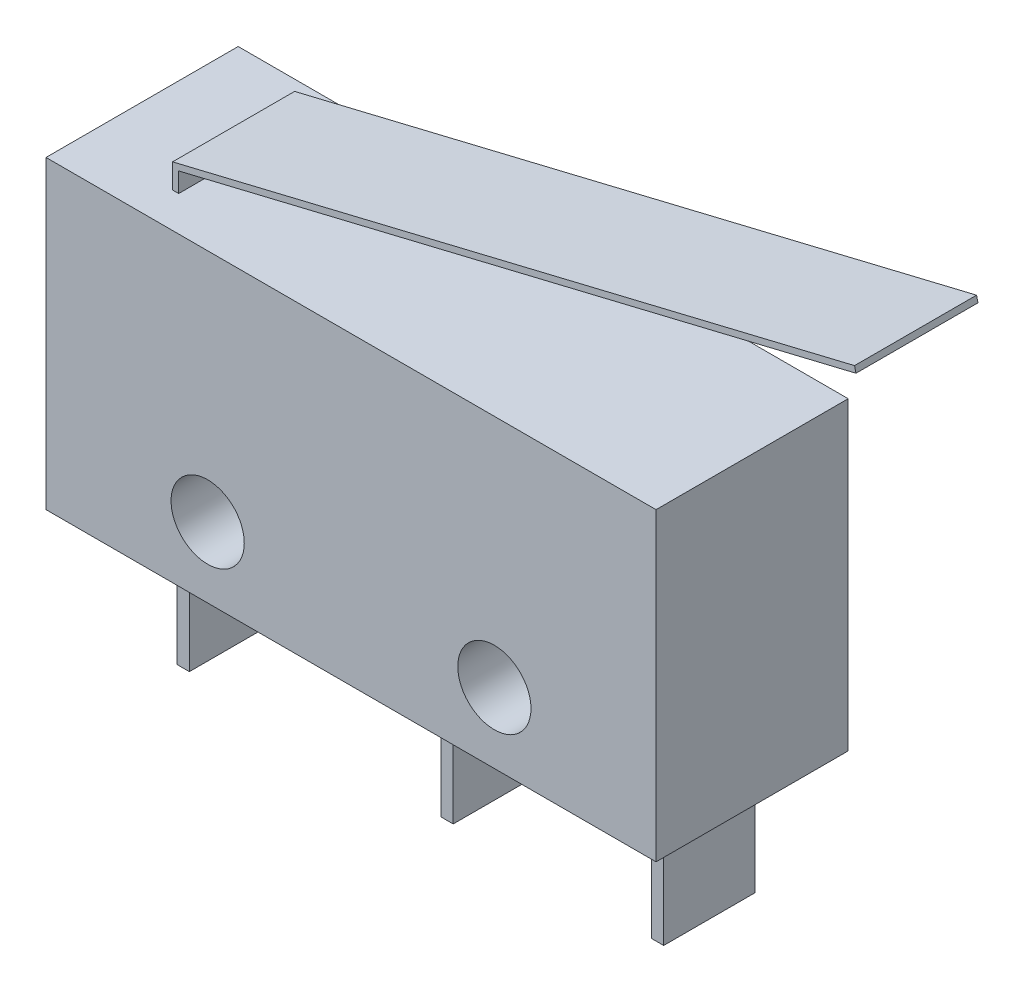
ISO-10303-21;
HEADER;
FILE_DESCRIPTION(('STEP AP214'),'2;1');
FILE_NAME('part.step','',(''),(''),'','','');
FILE_SCHEMA(('AUTOMOTIVE_DESIGN { 1 0 10303 214 1 1 1 1 }'));
ENDSEC;
DATA;
#1=APPLICATION_CONTEXT('core data for automotive mechanical design processes');
#2=APPLICATION_PROTOCOL_DEFINITION('international standard','automotive_design',2000,#1);
#3=PRODUCT_CONTEXT('',#1,'mechanical');
#4=PRODUCT('Part','Part','',(#3));
#5=PRODUCT_RELATED_PRODUCT_CATEGORY('part','',(#4));
#6=PRODUCT_DEFINITION_FORMATION('','',#4);
#7=PRODUCT_DEFINITION_CONTEXT('part definition',#1,'design');
#8=PRODUCT_DEFINITION('design','',#6,#7);
#9=PRODUCT_DEFINITION_SHAPE('','',#8);
#10=(LENGTH_UNIT() NAMED_UNIT(*) SI_UNIT(.MILLI.,.METRE.));
#11=(NAMED_UNIT(*) PLANE_ANGLE_UNIT() SI_UNIT($,.RADIAN.));
#12=(NAMED_UNIT(*) SI_UNIT($,.STERADIAN.) SOLID_ANGLE_UNIT());
#13=UNCERTAINTY_MEASURE_WITH_UNIT(LENGTH_MEASURE(1.E-05),#10,'distance_accuracy_value','');
#14=(GEOMETRIC_REPRESENTATION_CONTEXT(3) GLOBAL_UNCERTAINTY_ASSIGNED_CONTEXT((#13)) GLOBAL_UNIT_ASSIGNED_CONTEXT((#10,
#11,#12)) REPRESENTATION_CONTEXT('',''));
#15=CARTESIAN_POINT('',(0.,0.,0.));
#16=DIRECTION('',(0.,0.,1.));
#17=DIRECTION('',(1.,0.,0.));
#18=AXIS2_PLACEMENT_3D('',#15,#16,#17);
#19=CARTESIAN_POINT('',(0.,0.,6.3));
#20=DIRECTION('',(0.,0.,-1.));
#21=DIRECTION('',(-1.,0.,0.));
#22=AXIS2_PLACEMENT_3D('',#19,#20,#21);
#23=PLANE('',#22);
#24=DIRECTION('',(-1.,0.,0.));
#25=VECTOR('',#24,1.);
#26=CARTESIAN_POINT('',(-6.8,5.,6.3));
#27=LINE('',#26,#25);
#28=CARTESIAN_POINT('',(10.,5.,6.3));
#29=VERTEX_POINT('',#28);
#30=CARTESIAN_POINT('',(-10.,5.,6.3));
#31=VERTEX_POINT('',#30);
#32=EDGE_CURVE('E290',#29,#31,#27,.T.);
#33=ORIENTED_EDGE('',*,*,#32,.T.);
#34=DIRECTION('',(0.,-1.,0.));
#35=VECTOR('',#34,1.);
#36=CARTESIAN_POINT('',(-10.,5.,6.3));
#37=LINE('',#36,#35);
#38=CARTESIAN_POINT('',(-10.,-5.,6.3));
#39=VERTEX_POINT('',#38);
#40=EDGE_CURVE('E292',#31,#39,#37,.T.);
#41=ORIENTED_EDGE('',*,*,#40,.T.);
#42=DIRECTION('',(1.,0.,0.));
#43=VECTOR('',#42,1.);
#44=CARTESIAN_POINT('',(8.6,-5.,6.3));
#45=LINE('',#44,#43);
#46=CARTESIAN_POINT('',(10.,-5.,6.3));
#47=VERTEX_POINT('',#46);
#48=EDGE_CURVE('E284',#39,#47,#45,.T.);
#49=ORIENTED_EDGE('',*,*,#48,.T.);
#50=DIRECTION('',(0.,1.,0.));
#51=VECTOR('',#50,1.);
#52=CARTESIAN_POINT('',(10.,5.,6.3));
#53=LINE('',#52,#51);
#54=EDGE_CURVE('E287',#47,#29,#53,.T.);
#55=ORIENTED_EDGE('',*,*,#54,.T.);
#56=EDGE_LOOP('',(#33,#41,#49,#55));
#57=FACE_BOUND('',#56,.T.);
#58=CARTESIAN_POINT('',(-4.7,-2.7,6.3));
#59=DIRECTION('',(0.,0.,1.));
#60=DIRECTION('',(1.,0.,0.));
#61=AXIS2_PLACEMENT_3D('',#58,#59,#60);
#62=CIRCLE('',#61,1.2);
#63=CARTESIAN_POINT('',(-3.5,-2.7,6.3));
#64=VERTEX_POINT('',#63);
#65=EDGE_CURVE('E278',#64,#64,#62,.T.);
#66=ORIENTED_EDGE('',*,*,#65,.F.);
#67=EDGE_LOOP('',(#66));
#68=FACE_BOUND('',#67,.T.);
#69=CARTESIAN_POINT('',(4.7,-2.7,6.3));
#70=DIRECTION('',(0.,0.,1.));
#71=DIRECTION('',(1.,0.,0.));
#72=AXIS2_PLACEMENT_3D('',#69,#70,#71);
#73=CIRCLE('',#72,1.2);
#74=CARTESIAN_POINT('',(5.9,-2.7,6.3));
#75=VERTEX_POINT('',#74);
#76=EDGE_CURVE('E272',#75,#75,#73,.T.);
#77=ORIENTED_EDGE('',*,*,#76,.F.);
#78=EDGE_LOOP('',(#77));
#79=FACE_BOUND('',#78,.T.);
#80=ADVANCED_FACE('F35',(#57,#68,#79),#23,.F.);
#81=CARTESIAN_POINT('',(0.,0.,0.));
#82=DIRECTION('',(0.,0.,-1.));
#83=DIRECTION('',(-1.,0.,0.));
#84=AXIS2_PLACEMENT_3D('',#81,#82,#83);
#85=PLANE('',#84);
#86=DIRECTION('',(-1.,0.,0.));
#87=VECTOR('',#86,1.);
#88=CARTESIAN_POINT('',(-10.,5.,0.));
#89=LINE('',#88,#87);
#90=CARTESIAN_POINT('',(10.,5.,0.));
#91=VERTEX_POINT('',#90);
#92=CARTESIAN_POINT('',(-10.,5.,0.));
#93=VERTEX_POINT('',#92);
#94=EDGE_CURVE('E297',#91,#93,#89,.T.);
#95=ORIENTED_EDGE('',*,*,#94,.F.);
#96=DIRECTION('',(0.,1.,0.));
#97=VECTOR('',#96,1.);
#98=CARTESIAN_POINT('',(10.,5.,0.));
#99=LINE('',#98,#97);
#100=CARTESIAN_POINT('',(10.,-5.,0.));
#101=VERTEX_POINT('',#100);
#102=EDGE_CURVE('E281',#101,#91,#99,.T.);
#103=ORIENTED_EDGE('',*,*,#102,.F.);
#104=DIRECTION('',(1.,0.,0.));
#105=VECTOR('',#104,1.);
#106=CARTESIAN_POINT('',(1.7,-5.,0.));
#107=LINE('',#106,#105);
#108=CARTESIAN_POINT('',(-10.,-5.,0.));
#109=VERTEX_POINT('',#108);
#110=EDGE_CURVE('E288',#109,#101,#107,.T.);
#111=ORIENTED_EDGE('',*,*,#110,.F.);
#112=DIRECTION('',(0.,-1.,0.));
#113=VECTOR('',#112,1.);
#114=CARTESIAN_POINT('',(-10.,5.,0.));
#115=LINE('',#114,#113);
#116=EDGE_CURVE('E299',#93,#109,#115,.T.);
#117=ORIENTED_EDGE('',*,*,#116,.F.);
#118=EDGE_LOOP('',(#95,#103,#111,#117));
#119=FACE_BOUND('',#118,.T.);
#120=CARTESIAN_POINT('',(-4.7,-2.7,0.));
#121=DIRECTION('',(0.,0.,1.));
#122=DIRECTION('',(1.,0.,0.));
#123=AXIS2_PLACEMENT_3D('',#120,#121,#122);
#124=CIRCLE('',#123,1.2);
#125=CARTESIAN_POINT('',(-3.5,-2.7,0.));
#126=VERTEX_POINT('',#125);
#127=EDGE_CURVE('E275',#126,#126,#124,.T.);
#128=ORIENTED_EDGE('',*,*,#127,.T.);
#129=EDGE_LOOP('',(#128));
#130=FACE_BOUND('',#129,.T.);
#131=CARTESIAN_POINT('',(4.7,-2.7,0.));
#132=DIRECTION('',(0.,0.,1.));
#133=DIRECTION('',(1.,0.,0.));
#134=AXIS2_PLACEMENT_3D('',#131,#132,#133);
#135=CIRCLE('',#134,1.2);
#136=CARTESIAN_POINT('',(5.9,-2.7,0.));
#137=VERTEX_POINT('',#136);
#138=EDGE_CURVE('E271',#137,#137,#135,.T.);
#139=ORIENTED_EDGE('',*,*,#138,.T.);
#140=EDGE_LOOP('',(#139));
#141=FACE_BOUND('',#140,.T.);
#142=ADVANCED_FACE('F338',(#119,#130,#141),#85,.T.);
#143=CARTESIAN_POINT('',(10.,5.,6.3));
#144=DIRECTION('',(-1.,0.,0.));
#145=DIRECTION('',(0.,0.,1.));
#146=AXIS2_PLACEMENT_3D('',#143,#144,#145);
#147=PLANE('',#146);
#148=ORIENTED_EDGE('',*,*,#102,.T.);
#149=DIRECTION('',(0.,0.,-1.));
#150=VECTOR('',#149,1.);
#151=CARTESIAN_POINT('',(10.,5.,6.3));
#152=LINE('',#151,#150);
#153=EDGE_CURVE('E216',#29,#91,#152,.T.);
#154=ORIENTED_EDGE('',*,*,#153,.F.);
#155=ORIENTED_EDGE('',*,*,#54,.F.);
#156=DIRECTION('',(0.,0.,-1.));
#157=VECTOR('',#156,1.);
#158=CARTESIAN_POINT('',(10.,-5.,6.3));
#159=LINE('',#158,#157);
#160=EDGE_CURVE('E218',#47,#101,#159,.T.);
#161=ORIENTED_EDGE('',*,*,#160,.T.);
#162=EDGE_LOOP('',(#148,#154,#155,#161));
#163=FACE_BOUND('',#162,.T.);
#164=ADVANCED_FACE('F37',(#163),#147,.F.);
#165=CARTESIAN_POINT('',(-6.80000000000001,5.64251520211059,6.3));
#166=DIRECTION('',(-1.,0.,0.));
#167=DIRECTION('',(0.,-1.,0.));
#168=AXIS2_PLACEMENT_3D('',#165,#166,#167);
#169=PLANE('',#168);
#170=DIRECTION('',(0.,0.,-1.));
#171=VECTOR('',#170,1.);
#172=CARTESIAN_POINT('',(-6.80000000000001,5.64251520211059,6.3));
#173=LINE('',#172,#171);
#174=CARTESIAN_POINT('',(-6.80000000000001,5.64251520211059,5.15));
#175=VERTEX_POINT('',#174);
#176=CARTESIAN_POINT('',(-6.80000000000001,5.64251520211059,1.15));
#177=VERTEX_POINT('',#176);
#178=EDGE_CURVE('E212',#175,#177,#173,.T.);
#179=ORIENTED_EDGE('',*,*,#178,.F.);
#180=DIRECTION('',(0.,-1.,0.));
#181=VECTOR('',#180,1.);
#182=CARTESIAN_POINT('',(-6.80000000000001,5.64251520211059,5.15));
#183=LINE('',#182,#181);
#184=CARTESIAN_POINT('',(-6.8,5.,5.15));
#185=VERTEX_POINT('',#184);
#186=EDGE_CURVE('E758',#175,#185,#183,.T.);
#187=ORIENTED_EDGE('',*,*,#186,.T.);
#188=DIRECTION('',(0.,0.,-1.));
#189=VECTOR('',#188,1.);
#190=CARTESIAN_POINT('',(-6.8,5.,6.3));
#191=LINE('',#190,#189);
#192=CARTESIAN_POINT('',(-6.8,5.,1.15));
#193=VERTEX_POINT('',#192);
#194=EDGE_CURVE('E214',#185,#193,#191,.T.);
#195=ORIENTED_EDGE('',*,*,#194,.T.);
#196=DIRECTION('',(0.,1.,0.));
#197=VECTOR('',#196,1.);
#198=CARTESIAN_POINT('',(-6.80000000000001,5.64251520211059,1.15));
#199=LINE('',#198,#197);
#200=EDGE_CURVE('E432',#193,#177,#199,.T.);
#201=ORIENTED_EDGE('',*,*,#200,.T.);
#202=EDGE_LOOP('',(#179,#187,#195,#201));
#203=FACE_BOUND('',#202,.T.);
#204=ADVANCED_FACE('F350',(#203),#169,.F.);
#205=CARTESIAN_POINT('',(-6.80000000000001,5.64251520211059,6.3));
#206=DIRECTION('',(-0.234540056140332,0.972106456138261,0.));
#207=DIRECTION('',(-0.972106456138262,-0.234540056140333,0.));
#208=AXIS2_PLACEMENT_3D('',#205,#206,#207);
#209=PLANE('',#208);
#210=DIRECTION('',(0.,0.,-1.));
#211=VECTOR('',#210,1.);
#212=CARTESIAN_POINT('',(15.4053565024081,11.,6.3));
#213=LINE('',#212,#211);
#214=CARTESIAN_POINT('',(15.4053565024081,11.,5.15));
#215=VERTEX_POINT('',#214);
#216=CARTESIAN_POINT('',(15.4053565024081,11.,1.15));
#217=VERTEX_POINT('',#216);
#218=EDGE_CURVE('E205',#215,#217,#213,.T.);
#219=ORIENTED_EDGE('',*,*,#218,.F.);
#220=DIRECTION('',(-0.972106456138262,-0.234540056140333,0.));
#221=VECTOR('',#220,1.);
#222=CARTESIAN_POINT('',(-6.80000000000001,5.64251520211059,5.15));
#223=LINE('',#222,#221);
#224=EDGE_CURVE('E419',#215,#175,#223,.T.);
#225=ORIENTED_EDGE('',*,*,#224,.T.);
#226=ORIENTED_EDGE('',*,*,#178,.T.);
#227=DIRECTION('',(0.972106456138262,0.234540056140333,0.));
#228=VECTOR('',#227,1.);
#229=CARTESIAN_POINT('',(-6.80000000000001,5.64251520211059,1.15));
#230=LINE('',#229,#228);
#231=EDGE_CURVE('E422',#177,#217,#230,.T.);
#232=ORIENTED_EDGE('',*,*,#231,.T.);
#233=EDGE_LOOP('',(#219,#225,#226,#232));
#234=FACE_BOUND('',#233,.T.);
#235=ADVANCED_FACE('F355',(#234),#209,.F.);
#236=CARTESIAN_POINT('',(15.4053565024081,11.,6.3));
#237=DIRECTION('',(-0.972106456138265,-0.234540056140318,0.));
#238=DIRECTION('',(0.234540056140318,-0.972106456138265,0.));
#239=AXIS2_PLACEMENT_3D('',#236,#237,#238);
#240=PLANE('',#239);
#241=DIRECTION('',(0.,0.,-1.));
#242=VECTOR('',#241,1.);
#243=CARTESIAN_POINT('',(15.35844849118,11.1944212912277,6.3));
#244=LINE('',#243,#242);
#245=CARTESIAN_POINT('',(15.35844849118,11.1944212912277,5.15));
#246=VERTEX_POINT('',#245);
#247=CARTESIAN_POINT('',(15.35844849118,11.1944212912277,1.15));
#248=VERTEX_POINT('',#247);
#249=EDGE_CURVE('E203',#246,#248,#244,.T.);
#250=ORIENTED_EDGE('',*,*,#249,.F.);
#251=DIRECTION('',(0.234540056140318,-0.972106456138265,0.));
#252=VECTOR('',#251,1.);
#253=CARTESIAN_POINT('',(15.4053565024081,11.,5.15));
#254=LINE('',#253,#252);
#255=EDGE_CURVE('E185',#246,#215,#254,.T.);
#256=ORIENTED_EDGE('',*,*,#255,.T.);
#257=ORIENTED_EDGE('',*,*,#218,.T.);
#258=DIRECTION('',(-0.234540056140318,0.972106456138265,0.));
#259=VECTOR('',#258,1.);
#260=CARTESIAN_POINT('',(15.4053565024081,11.,1.15));
#261=LINE('',#260,#259);
#262=EDGE_CURVE('E425',#217,#248,#261,.T.);
#263=ORIENTED_EDGE('',*,*,#262,.T.);
#264=EDGE_LOOP('',(#250,#256,#257,#263));
#265=FACE_BOUND('',#264,.T.);
#266=ADVANCED_FACE('F408',(#265),#240,.F.);
#267=CARTESIAN_POINT('',(15.35844849118,11.1944212912277,6.3));
#268=DIRECTION('',(0.234540056140333,-0.972106456138262,0.));
#269=DIRECTION('',(0.972106456138262,0.234540056140333,0.));
#270=AXIS2_PLACEMENT_3D('',#267,#268,#269);
#271=PLANE('',#270);
#272=DIRECTION('',(0.,0.,-1.));
#273=VECTOR('',#272,1.);
#274=CARTESIAN_POINT('',(-7.,5.8,6.3));
#275=LINE('',#274,#273);
#276=CARTESIAN_POINT('',(-7.,5.8,5.15));
#277=VERTEX_POINT('',#276);
#278=CARTESIAN_POINT('',(-7.,5.8,1.15));
#279=VERTEX_POINT('',#278);
#280=EDGE_CURVE('E195',#277,#279,#275,.T.);
#281=ORIENTED_EDGE('',*,*,#280,.F.);
#282=DIRECTION('',(0.972106456138262,0.234540056140333,0.));
#283=VECTOR('',#282,1.);
#284=CARTESIAN_POINT('',(15.35844849118,11.1944212912277,5.15));
#285=LINE('',#284,#283);
#286=EDGE_CURVE('E182',#277,#246,#285,.T.);
#287=ORIENTED_EDGE('',*,*,#286,.T.);
#288=ORIENTED_EDGE('',*,*,#249,.T.);
#289=DIRECTION('',(-0.972106456138262,-0.234540056140333,0.));
#290=VECTOR('',#289,1.);
#291=CARTESIAN_POINT('',(15.35844849118,11.1944212912277,1.15));
#292=LINE('',#291,#290);
#293=EDGE_CURVE('E202',#248,#279,#292,.T.);
#294=ORIENTED_EDGE('',*,*,#293,.T.);
#295=EDGE_LOOP('',(#281,#287,#288,#294));
#296=FACE_BOUND('',#295,.T.);
#297=ADVANCED_FACE('F200',(#296),#271,.F.);
#298=CARTESIAN_POINT('',(-7.,5.8,6.3));
#299=DIRECTION('',(1.,0.,0.));
#300=DIRECTION('',(0.,0.,-1.));
#301=AXIS2_PLACEMENT_3D('',#298,#299,#300);
#302=PLANE('',#301);
#303=DIRECTION('',(0.,0.,-1.));
#304=VECTOR('',#303,1.);
#305=CARTESIAN_POINT('',(-7.,5.,6.3));
#306=LINE('',#305,#304);
#307=CARTESIAN_POINT('',(-7.,5.,5.15));
#308=VERTEX_POINT('',#307);
#309=CARTESIAN_POINT('',(-7.,5.,1.15));
#310=VERTEX_POINT('',#309);
#311=EDGE_CURVE('E197',#308,#310,#306,.T.);
#312=ORIENTED_EDGE('',*,*,#311,.F.);
#313=DIRECTION('',(0.,-1.,0.));
#314=VECTOR('',#313,1.);
#315=CARTESIAN_POINT('',(-7.,5.,5.15));
#316=LINE('',#315,#314);
#317=EDGE_CURVE('E50',#277,#308,#316,.T.);
#318=ORIENTED_EDGE('',*,*,#317,.F.);
#319=ORIENTED_EDGE('',*,*,#280,.T.);
#320=DIRECTION('',(0.,1.,0.));
#321=VECTOR('',#320,1.);
#322=CARTESIAN_POINT('',(-7.,5.,1.15));
#323=LINE('',#322,#321);
#324=EDGE_CURVE('E757',#310,#279,#323,.T.);
#325=ORIENTED_EDGE('',*,*,#324,.F.);
#326=EDGE_LOOP('',(#312,#318,#319,#325));
#327=FACE_BOUND('',#326,.T.);
#328=ADVANCED_FACE('F193',(#327),#302,.F.);
#329=CARTESIAN_POINT('',(-10.,5.,6.3));
#330=DIRECTION('',(0.,-1.,0.));
#331=DIRECTION('',(0.,0.,-1.));
#332=AXIS2_PLACEMENT_3D('',#329,#330,#331);
#333=PLANE('',#332);
#334=ORIENTED_EDGE('',*,*,#194,.F.);
#335=DIRECTION('',(-1.,0.,0.));
#336=VECTOR('',#335,1.);
#337=CARTESIAN_POINT('',(15.4053565024081,5.,5.15));
#338=LINE('',#337,#336);
#339=EDGE_CURVE('E189',#185,#308,#338,.T.);
#340=ORIENTED_EDGE('',*,*,#339,.T.);
#341=ORIENTED_EDGE('',*,*,#311,.T.);
#342=DIRECTION('',(-1.,0.,0.));
#343=VECTOR('',#342,1.);
#344=CARTESIAN_POINT('',(15.4053565024081,5.,1.15));
#345=LINE('',#344,#343);
#346=EDGE_CURVE('E434',#193,#310,#345,.T.);
#347=ORIENTED_EDGE('',*,*,#346,.F.);
#348=EDGE_LOOP('',(#334,#340,#341,#347));
#349=FACE_BOUND('',#348,.T.);
#350=DIRECTION('',(0.,0.,-1.));
#351=VECTOR('',#350,1.);
#352=CARTESIAN_POINT('',(-10.,5.,6.3));
#353=LINE('',#352,#351);
#354=EDGE_CURVE('E207',#31,#93,#353,.T.);
#355=ORIENTED_EDGE('',*,*,#354,.F.);
#356=ORIENTED_EDGE('',*,*,#32,.F.);
#357=ORIENTED_EDGE('',*,*,#153,.T.);
#358=ORIENTED_EDGE('',*,*,#94,.T.);
#359=EDGE_LOOP('',(#355,#356,#357,#358));
#360=FACE_BOUND('',#359,.T.);
#361=ADVANCED_FACE('F347',(#349,#360),#333,.F.);
#362=CARTESIAN_POINT('',(-10.,5.,6.3));
#363=DIRECTION('',(1.,0.,0.));
#364=DIRECTION('',(0.,0.,-1.));
#365=AXIS2_PLACEMENT_3D('',#362,#363,#364);
#366=PLANE('',#365);
#367=ORIENTED_EDGE('',*,*,#116,.T.);
#368=DIRECTION('',(0.,0.,-1.));
#369=VECTOR('',#368,1.);
#370=CARTESIAN_POINT('',(-10.,-5.,6.3));
#371=LINE('',#370,#369);
#372=EDGE_CURVE('E325',#39,#109,#371,.T.);
#373=ORIENTED_EDGE('',*,*,#372,.F.);
#374=ORIENTED_EDGE('',*,*,#40,.F.);
#375=ORIENTED_EDGE('',*,*,#354,.T.);
#376=EDGE_LOOP('',(#367,#373,#374,#375));
#377=FACE_BOUND('',#376,.T.);
#378=ADVANCED_FACE('F331',(#377),#366,.F.);
#379=CARTESIAN_POINT('',(-7.35,-5.,6.3));
#380=DIRECTION('',(1.,0.,0.));
#381=DIRECTION('',(0.,1.,0.));
#382=AXIS2_PLACEMENT_3D('',#379,#380,#381);
#383=PLANE('',#382);
#384=DIRECTION('',(0.,0.,-1.));
#385=VECTOR('',#384,1.);
#386=CARTESIAN_POINT('',(-7.35,-8.9,6.3));
#387=LINE('',#386,#385);
#388=CARTESIAN_POINT('',(-7.35,-8.9,4.65));
#389=VERTEX_POINT('',#388);
#390=CARTESIAN_POINT('',(-7.35,-8.9,1.65));
#391=VERTEX_POINT('',#390);
#392=EDGE_CURVE('E321',#389,#391,#387,.T.);
#393=ORIENTED_EDGE('',*,*,#392,.F.);
#394=DIRECTION('',(0.,1.,0.));
#395=VECTOR('',#394,1.);
#396=CARTESIAN_POINT('',(-7.35,-5.,4.65));
#397=LINE('',#396,#395);
#398=CARTESIAN_POINT('',(-7.35,-5.,4.65));
#399=VERTEX_POINT('',#398);
#400=EDGE_CURVE('E457',#389,#399,#397,.T.);
#401=ORIENTED_EDGE('',*,*,#400,.T.);
#402=DIRECTION('',(0.,0.,-1.));
#403=VECTOR('',#402,1.);
#404=CARTESIAN_POINT('',(-7.35,-5.,6.3));
#405=LINE('',#404,#403);
#406=CARTESIAN_POINT('',(-7.35,-5.,1.65));
#407=VERTEX_POINT('',#406);
#408=EDGE_CURVE('E323',#399,#407,#405,.T.);
#409=ORIENTED_EDGE('',*,*,#408,.T.);
#410=DIRECTION('',(0.,-1.,0.));
#411=VECTOR('',#410,1.);
#412=CARTESIAN_POINT('',(-7.35,-5.,1.65));
#413=LINE('',#412,#411);
#414=EDGE_CURVE('E268',#407,#391,#413,.T.);
#415=ORIENTED_EDGE('',*,*,#414,.T.);
#416=EDGE_LOOP('',(#393,#401,#409,#415));
#417=FACE_BOUND('',#416,.T.);
#418=ADVANCED_FACE('F395',(#417),#383,.F.);
#419=CARTESIAN_POINT('',(-6.95,-8.9,6.3));
#420=DIRECTION('',(0.,1.,0.));
#421=DIRECTION('',(-1.,0.,0.));
#422=AXIS2_PLACEMENT_3D('',#419,#420,#421);
#423=PLANE('',#422);
#424=DIRECTION('',(0.,0.,-1.));
#425=VECTOR('',#424,1.);
#426=CARTESIAN_POINT('',(-6.95,-8.9,6.3));
#427=LINE('',#426,#425);
#428=CARTESIAN_POINT('',(-6.95,-8.9,4.65));
#429=VERTEX_POINT('',#428);
#430=CARTESIAN_POINT('',(-6.95,-8.9,1.65));
#431=VERTEX_POINT('',#430);
#432=EDGE_CURVE('E319',#429,#431,#427,.T.);
#433=ORIENTED_EDGE('',*,*,#432,.F.);
#434=DIRECTION('',(1.,0.,0.));
#435=VECTOR('',#434,1.);
#436=CARTESIAN_POINT('',(-10.,-8.9,4.65));
#437=LINE('',#436,#435);
#438=EDGE_CURVE('E58',#389,#429,#437,.T.);
#439=ORIENTED_EDGE('',*,*,#438,.F.);
#440=ORIENTED_EDGE('',*,*,#392,.T.);
#441=DIRECTION('',(1.,0.,0.));
#442=VECTOR('',#441,1.);
#443=CARTESIAN_POINT('',(-10.,-8.9,1.65));
#444=LINE('',#443,#442);
#445=EDGE_CURVE('E245',#391,#431,#444,.T.);
#446=ORIENTED_EDGE('',*,*,#445,.T.);
#447=EDGE_LOOP('',(#433,#439,#440,#446));
#448=FACE_BOUND('',#447,.T.);
#449=ADVANCED_FACE('F391',(#448),#423,.F.);
#450=CARTESIAN_POINT('',(-6.95,-5.,6.3));
#451=DIRECTION('',(-1.,0.,0.));
#452=DIRECTION('',(0.,-1.,0.));
#453=AXIS2_PLACEMENT_3D('',#450,#451,#452);
#454=PLANE('',#453);
#455=DIRECTION('',(0.,0.,-1.));
#456=VECTOR('',#455,1.);
#457=CARTESIAN_POINT('',(-6.95,-5.,6.3));
#458=LINE('',#457,#456);
#459=CARTESIAN_POINT('',(-6.95,-5.,4.65));
#460=VERTEX_POINT('',#459);
#461=CARTESIAN_POINT('',(-6.95,-5.,1.65));
#462=VERTEX_POINT('',#461);
#463=EDGE_CURVE('E317',#460,#462,#458,.T.);
#464=ORIENTED_EDGE('',*,*,#463,.F.);
#465=DIRECTION('',(0.,-1.,0.));
#466=VECTOR('',#465,1.);
#467=CARTESIAN_POINT('',(-6.95,-5.,4.65));
#468=LINE('',#467,#466);
#469=EDGE_CURVE('E456',#460,#429,#468,.T.);
#470=ORIENTED_EDGE('',*,*,#469,.T.);
#471=ORIENTED_EDGE('',*,*,#432,.T.);
#472=DIRECTION('',(0.,1.,0.));
#473=VECTOR('',#472,1.);
#474=CARTESIAN_POINT('',(-6.95,-5.,1.65));
#475=LINE('',#474,#473);
#476=EDGE_CURVE('E265',#431,#462,#475,.T.);
#477=ORIENTED_EDGE('',*,*,#476,.T.);
#478=EDGE_LOOP('',(#464,#470,#471,#477));
#479=FACE_BOUND('',#478,.T.);
#480=ADVANCED_FACE('F387',(#479),#454,.F.);
#481=CARTESIAN_POINT('',(1.3,-5.,6.3));
#482=DIRECTION('',(1.,0.,0.));
#483=DIRECTION('',(0.,1.,0.));
#484=AXIS2_PLACEMENT_3D('',#481,#482,#483);
#485=PLANE('',#484);
#486=DIRECTION('',(0.,0.,-1.));
#487=VECTOR('',#486,1.);
#488=CARTESIAN_POINT('',(1.3,-8.9,6.3));
#489=LINE('',#488,#487);
#490=CARTESIAN_POINT('',(1.3,-8.9,4.65));
#491=VERTEX_POINT('',#490);
#492=CARTESIAN_POINT('',(1.3,-8.9,1.65));
#493=VERTEX_POINT('',#492);
#494=EDGE_CURVE('E313',#491,#493,#489,.T.);
#495=ORIENTED_EDGE('',*,*,#494,.F.);
#496=DIRECTION('',(0.,1.,0.));
#497=VECTOR('',#496,1.);
#498=CARTESIAN_POINT('',(1.3,-5.,4.65));
#499=LINE('',#498,#497);
#500=CARTESIAN_POINT('',(1.3,-5.,4.65));
#501=VERTEX_POINT('',#500);
#502=EDGE_CURVE('E453',#491,#501,#499,.T.);
#503=ORIENTED_EDGE('',*,*,#502,.T.);
#504=DIRECTION('',(0.,0.,-1.));
#505=VECTOR('',#504,1.);
#506=CARTESIAN_POINT('',(1.3,-5.,6.3));
#507=LINE('',#506,#505);
#508=CARTESIAN_POINT('',(1.3,-5.,1.65));
#509=VERTEX_POINT('',#508);
#510=EDGE_CURVE('E315',#501,#509,#507,.T.);
#511=ORIENTED_EDGE('',*,*,#510,.T.);
#512=DIRECTION('',(0.,-1.,0.));
#513=VECTOR('',#512,1.);
#514=CARTESIAN_POINT('',(1.3,-5.,1.65));
#515=LINE('',#514,#513);
#516=EDGE_CURVE('E260',#509,#493,#515,.T.);
#517=ORIENTED_EDGE('',*,*,#516,.T.);
#518=EDGE_LOOP('',(#495,#503,#511,#517));
#519=FACE_BOUND('',#518,.T.);
#520=ADVANCED_FACE('F383',(#519),#485,.F.);
#521=CARTESIAN_POINT('',(1.7,-8.9,6.3));
#522=DIRECTION('',(0.,1.,0.));
#523=DIRECTION('',(-1.,0.,0.));
#524=AXIS2_PLACEMENT_3D('',#521,#522,#523);
#525=PLANE('',#524);
#526=DIRECTION('',(0.,0.,-1.));
#527=VECTOR('',#526,1.);
#528=CARTESIAN_POINT('',(1.7,-8.9,6.3));
#529=LINE('',#528,#527);
#530=CARTESIAN_POINT('',(1.7,-8.9,4.65));
#531=VERTEX_POINT('',#530);
#532=CARTESIAN_POINT('',(1.7,-8.9,1.65));
#533=VERTEX_POINT('',#532);
#534=EDGE_CURVE('E311',#531,#533,#529,.T.);
#535=ORIENTED_EDGE('',*,*,#534,.F.);
#536=EDGE_CURVE('E446',#491,#531,#437,.T.);
#537=ORIENTED_EDGE('',*,*,#536,.F.);
#538=ORIENTED_EDGE('',*,*,#494,.T.);
#539=EDGE_CURVE('E242',#493,#533,#444,.T.);
#540=ORIENTED_EDGE('',*,*,#539,.T.);
#541=EDGE_LOOP('',(#535,#537,#538,#540));
#542=FACE_BOUND('',#541,.T.);
#543=ADVANCED_FACE('F379',(#542),#525,.F.);
#544=CARTESIAN_POINT('',(1.7,-5.,6.3));
#545=DIRECTION('',(-1.,0.,0.));
#546=DIRECTION('',(0.,-1.,0.));
#547=AXIS2_PLACEMENT_3D('',#544,#545,#546);
#548=PLANE('',#547);
#549=DIRECTION('',(0.,0.,-1.));
#550=VECTOR('',#549,1.);
#551=CARTESIAN_POINT('',(1.7,-5.,6.3));
#552=LINE('',#551,#550);
#553=CARTESIAN_POINT('',(1.7,-5.,4.65));
#554=VERTEX_POINT('',#553);
#555=CARTESIAN_POINT('',(1.7,-5.,1.65));
#556=VERTEX_POINT('',#555);
#557=EDGE_CURVE('E309',#554,#556,#552,.T.);
#558=ORIENTED_EDGE('',*,*,#557,.F.);
#559=DIRECTION('',(0.,-1.,0.));
#560=VECTOR('',#559,1.);
#561=CARTESIAN_POINT('',(1.7,-5.,4.65));
#562=LINE('',#561,#560);
#563=EDGE_CURVE('E450',#554,#531,#562,.T.);
#564=ORIENTED_EDGE('',*,*,#563,.T.);
#565=ORIENTED_EDGE('',*,*,#534,.T.);
#566=DIRECTION('',(0.,1.,0.));
#567=VECTOR('',#566,1.);
#568=CARTESIAN_POINT('',(1.7,-5.,1.65));
#569=LINE('',#568,#567);
#570=EDGE_CURVE('E256',#533,#556,#569,.T.);
#571=ORIENTED_EDGE('',*,*,#570,.T.);
#572=EDGE_LOOP('',(#558,#564,#565,#571));
#573=FACE_BOUND('',#572,.T.);
#574=ADVANCED_FACE('F375',(#573),#548,.F.);
#575=CARTESIAN_POINT('',(1.7,-5.,6.3));
#576=DIRECTION('',(0.,1.,0.));
#577=DIRECTION('',(0.,0.,1.));
#578=AXIS2_PLACEMENT_3D('',#575,#576,#577);
#579=PLANE('',#578);
#580=ORIENTED_EDGE('',*,*,#408,.F.);
#581=DIRECTION('',(1.,0.,0.));
#582=VECTOR('',#581,1.);
#583=CARTESIAN_POINT('',(-10.,-5.,4.65));
#584=LINE('',#583,#582);
#585=EDGE_CURVE('E444',#399,#460,#584,.T.);
#586=ORIENTED_EDGE('',*,*,#585,.T.);
#587=ORIENTED_EDGE('',*,*,#463,.T.);
#588=DIRECTION('',(1.,0.,0.));
#589=VECTOR('',#588,1.);
#590=CARTESIAN_POINT('',(-10.,-5.,1.65));
#591=LINE('',#590,#589);
#592=EDGE_CURVE('E243',#407,#462,#591,.T.);
#593=ORIENTED_EDGE('',*,*,#592,.F.);
#594=EDGE_LOOP('',(#580,#586,#587,#593));
#595=FACE_BOUND('',#594,.T.);
#596=ORIENTED_EDGE('',*,*,#510,.F.);
#597=EDGE_CURVE('E443',#501,#554,#584,.T.);
#598=ORIENTED_EDGE('',*,*,#597,.T.);
#599=ORIENTED_EDGE('',*,*,#557,.T.);
#600=EDGE_CURVE('E248',#509,#556,#591,.T.);
#601=ORIENTED_EDGE('',*,*,#600,.F.);
#602=EDGE_LOOP('',(#596,#598,#599,#601));
#603=FACE_BOUND('',#602,.T.);
#604=CARTESIAN_POINT('',(8.2,-5.,4.65));
#605=VERTEX_POINT('',#604);
#606=CARTESIAN_POINT('',(8.6,-5.,4.65));
#607=VERTEX_POINT('',#606);
#608=EDGE_CURVE('E440',#605,#607,#584,.T.);
#609=ORIENTED_EDGE('',*,*,#608,.T.);
#610=DIRECTION('',(0.,0.,-1.));
#611=VECTOR('',#610,1.);
#612=CARTESIAN_POINT('',(8.6,-5.,6.3));
#613=LINE('',#612,#611);
#614=CARTESIAN_POINT('',(8.6,-5.,1.65));
#615=VERTEX_POINT('',#614);
#616=EDGE_CURVE('E224',#607,#615,#613,.T.);
#617=ORIENTED_EDGE('',*,*,#616,.T.);
#618=CARTESIAN_POINT('',(8.2,-5.,1.65));
#619=VERTEX_POINT('',#618);
#620=EDGE_CURVE('E236',#619,#615,#591,.T.);
#621=ORIENTED_EDGE('',*,*,#620,.F.);
#622=DIRECTION('',(0.,0.,-1.));
#623=VECTOR('',#622,1.);
#624=CARTESIAN_POINT('',(8.2,-5.,6.3));
#625=LINE('',#624,#623);
#626=EDGE_CURVE('E307',#605,#619,#625,.T.);
#627=ORIENTED_EDGE('',*,*,#626,.F.);
#628=EDGE_LOOP('',(#609,#617,#621,#627));
#629=FACE_BOUND('',#628,.T.);
#630=ORIENTED_EDGE('',*,*,#110,.T.);
#631=ORIENTED_EDGE('',*,*,#160,.F.);
#632=ORIENTED_EDGE('',*,*,#48,.F.);
#633=ORIENTED_EDGE('',*,*,#372,.T.);
#634=EDGE_LOOP('',(#630,#631,#632,#633));
#635=FACE_BOUND('',#634,.T.);
#636=ADVANCED_FACE('F343',(#595,#603,#629,#635),#579,.F.);
#637=CARTESIAN_POINT('',(8.2,-5.,6.3));
#638=DIRECTION('',(1.,0.,0.));
#639=DIRECTION('',(0.,0.,-1.));
#640=AXIS2_PLACEMENT_3D('',#637,#638,#639);
#641=PLANE('',#640);
#642=DIRECTION('',(0.,0.,-1.));
#643=VECTOR('',#642,1.);
#644=CARTESIAN_POINT('',(8.2,-8.9,6.3));
#645=LINE('',#644,#643);
#646=CARTESIAN_POINT('',(8.2,-8.9,4.65));
#647=VERTEX_POINT('',#646);
#648=CARTESIAN_POINT('',(8.2,-8.9,1.65));
#649=VERTEX_POINT('',#648);
#650=EDGE_CURVE('E241',#647,#649,#645,.T.);
#651=ORIENTED_EDGE('',*,*,#650,.F.);
#652=DIRECTION('',(0.,1.,0.));
#653=VECTOR('',#652,1.);
#654=CARTESIAN_POINT('',(8.2,-5.,4.65));
#655=LINE('',#654,#653);
#656=EDGE_CURVE('E447',#647,#605,#655,.T.);
#657=ORIENTED_EDGE('',*,*,#656,.T.);
#658=ORIENTED_EDGE('',*,*,#626,.T.);
#659=DIRECTION('',(0.,-1.,0.));
#660=VECTOR('',#659,1.);
#661=CARTESIAN_POINT('',(8.2,-5.,1.65));
#662=LINE('',#661,#660);
#663=EDGE_CURVE('E252',#619,#649,#662,.T.);
#664=ORIENTED_EDGE('',*,*,#663,.T.);
#665=EDGE_LOOP('',(#651,#657,#658,#664));
#666=FACE_BOUND('',#665,.T.);
#667=ADVANCED_FACE('F370',(#666),#641,.F.);
#668=CARTESIAN_POINT('',(8.6,-8.9,6.3));
#669=DIRECTION('',(0.,1.,0.));
#670=DIRECTION('',(-1.,0.,0.));
#671=AXIS2_PLACEMENT_3D('',#668,#669,#670);
#672=PLANE('',#671);
#673=DIRECTION('',(0.,0.,-1.));
#674=VECTOR('',#673,1.);
#675=CARTESIAN_POINT('',(8.6,-8.9,6.3));
#676=LINE('',#675,#674);
#677=CARTESIAN_POINT('',(8.6,-8.9,4.65));
#678=VERTEX_POINT('',#677);
#679=CARTESIAN_POINT('',(8.6,-8.9,1.65));
#680=VERTEX_POINT('',#679);
#681=EDGE_CURVE('E226',#678,#680,#676,.T.);
#682=ORIENTED_EDGE('',*,*,#681,.F.);
#683=EDGE_CURVE('E439',#647,#678,#437,.T.);
#684=ORIENTED_EDGE('',*,*,#683,.F.);
#685=ORIENTED_EDGE('',*,*,#650,.T.);
#686=EDGE_CURVE('E233',#649,#680,#444,.T.);
#687=ORIENTED_EDGE('',*,*,#686,.T.);
#688=EDGE_LOOP('',(#682,#684,#685,#687));
#689=FACE_BOUND('',#688,.T.);
#690=ADVANCED_FACE('F238',(#689),#672,.F.);
#691=CARTESIAN_POINT('',(8.6,-5.,6.3));
#692=DIRECTION('',(-1.,0.,0.));
#693=DIRECTION('',(0.,0.,1.));
#694=AXIS2_PLACEMENT_3D('',#691,#692,#693);
#695=PLANE('',#694);
#696=ORIENTED_EDGE('',*,*,#616,.F.);
#697=DIRECTION('',(0.,-1.,0.));
#698=VECTOR('',#697,1.);
#699=CARTESIAN_POINT('',(8.6,-5.,4.65));
#700=LINE('',#699,#698);
#701=EDGE_CURVE('E11',#607,#678,#700,.T.);
#702=ORIENTED_EDGE('',*,*,#701,.T.);
#703=ORIENTED_EDGE('',*,*,#681,.T.);
#704=DIRECTION('',(0.,1.,0.));
#705=VECTOR('',#704,1.);
#706=CARTESIAN_POINT('',(8.6,-5.,1.65));
#707=LINE('',#706,#705);
#708=EDGE_CURVE('E43',#680,#615,#707,.T.);
#709=ORIENTED_EDGE('',*,*,#708,.T.);
#710=EDGE_LOOP('',(#696,#702,#703,#709));
#711=FACE_BOUND('',#710,.T.);
#712=ADVANCED_FACE('F223',(#711),#695,.F.);
#713=CARTESIAN_POINT('',(-4.7,-2.7,6.3));
#714=DIRECTION('',(0.,0.,-1.));
#715=DIRECTION('',(-1.,0.,0.));
#716=AXIS2_PLACEMENT_3D('',#713,#714,#715);
#717=CYLINDRICAL_SURFACE('',#716,1.2);
#718=ORIENTED_EDGE('',*,*,#65,.T.);
#719=EDGE_LOOP('',(#718));
#720=FACE_BOUND('',#719,.T.);
#721=ORIENTED_EDGE('',*,*,#127,.F.);
#722=EDGE_LOOP('',(#721));
#723=FACE_BOUND('',#722,.T.);
#724=ADVANCED_FACE('F363',(#720,#723),#717,.F.);
#725=CARTESIAN_POINT('',(4.7,-2.7,6.3));
#726=DIRECTION('',(0.,0.,-1.));
#727=DIRECTION('',(-1.,0.,0.));
#728=AXIS2_PLACEMENT_3D('',#725,#726,#727);
#729=CYLINDRICAL_SURFACE('',#728,1.2);
#730=ORIENTED_EDGE('',*,*,#76,.T.);
#731=EDGE_LOOP('',(#730));
#732=FACE_BOUND('',#731,.T.);
#733=ORIENTED_EDGE('',*,*,#138,.F.);
#734=EDGE_LOOP('',(#733));
#735=FACE_BOUND('',#734,.T.);
#736=ADVANCED_FACE('F498',(#732,#735),#729,.F.);
#737=CARTESIAN_POINT('',(-10.,-8.9,1.65));
#738=DIRECTION('',(0.,0.,1.));
#739=DIRECTION('',(1.,0.,0.));
#740=AXIS2_PLACEMENT_3D('',#737,#738,#739);
#741=PLANE('',#740);
#742=ORIENTED_EDGE('',*,*,#620,.T.);
#743=ORIENTED_EDGE('',*,*,#708,.F.);
#744=ORIENTED_EDGE('',*,*,#686,.F.);
#745=ORIENTED_EDGE('',*,*,#663,.F.);
#746=EDGE_LOOP('',(#742,#743,#744,#745));
#747=FACE_BOUND('',#746,.T.);
#748=ADVANCED_FACE('F231',(#747),#741,.F.);
#749=ORIENTED_EDGE('',*,*,#600,.T.);
#750=ORIENTED_EDGE('',*,*,#570,.F.);
#751=ORIENTED_EDGE('',*,*,#539,.F.);
#752=ORIENTED_EDGE('',*,*,#516,.F.);
#753=EDGE_LOOP('',(#749,#750,#751,#752));
#754=FACE_BOUND('',#753,.T.);
#755=ADVANCED_FACE('F466',(#754),#741,.F.);
#756=ORIENTED_EDGE('',*,*,#592,.T.);
#757=ORIENTED_EDGE('',*,*,#476,.F.);
#758=ORIENTED_EDGE('',*,*,#445,.F.);
#759=ORIENTED_EDGE('',*,*,#414,.F.);
#760=EDGE_LOOP('',(#756,#757,#758,#759));
#761=FACE_BOUND('',#760,.T.);
#762=ADVANCED_FACE('F482',(#761),#741,.F.);
#763=CARTESIAN_POINT('',(-10.,-8.9,4.65));
#764=DIRECTION('',(0.,0.,-1.));
#765=DIRECTION('',(-1.,0.,0.));
#766=AXIS2_PLACEMENT_3D('',#763,#764,#765);
#767=PLANE('',#766);
#768=ORIENTED_EDGE('',*,*,#683,.T.);
#769=ORIENTED_EDGE('',*,*,#701,.F.);
#770=ORIENTED_EDGE('',*,*,#608,.F.);
#771=ORIENTED_EDGE('',*,*,#656,.F.);
#772=EDGE_LOOP('',(#768,#769,#770,#771));
#773=FACE_BOUND('',#772,.T.);
#774=ADVANCED_FACE('F487',(#773),#767,.F.);
#775=ORIENTED_EDGE('',*,*,#536,.T.);
#776=ORIENTED_EDGE('',*,*,#563,.F.);
#777=ORIENTED_EDGE('',*,*,#597,.F.);
#778=ORIENTED_EDGE('',*,*,#502,.F.);
#779=EDGE_LOOP('',(#775,#776,#777,#778));
#780=FACE_BOUND('',#779,.T.);
#781=ADVANCED_FACE('F484',(#780),#767,.F.);
#782=ORIENTED_EDGE('',*,*,#438,.T.);
#783=ORIENTED_EDGE('',*,*,#469,.F.);
#784=ORIENTED_EDGE('',*,*,#585,.F.);
#785=ORIENTED_EDGE('',*,*,#400,.F.);
#786=EDGE_LOOP('',(#782,#783,#784,#785));
#787=FACE_BOUND('',#786,.T.);
#788=ADVANCED_FACE('F486',(#787),#767,.F.);
#789=CARTESIAN_POINT('',(15.4053565024081,5.,1.15));
#790=DIRECTION('',(0.,0.,1.));
#791=DIRECTION('',(1.,0.,0.));
#792=AXIS2_PLACEMENT_3D('',#789,#790,#791);
#793=PLANE('',#792);
#794=ORIENTED_EDGE('',*,*,#346,.T.);
#795=ORIENTED_EDGE('',*,*,#324,.T.);
#796=ORIENTED_EDGE('',*,*,#293,.F.);
#797=ORIENTED_EDGE('',*,*,#262,.F.);
#798=ORIENTED_EDGE('',*,*,#231,.F.);
#799=ORIENTED_EDGE('',*,*,#200,.F.);
#800=EDGE_LOOP('',(#794,#795,#796,#797,#798,#799));
#801=FACE_BOUND('',#800,.T.);
#802=ADVANCED_FACE('F428',(#801),#793,.F.);
#803=CARTESIAN_POINT('',(15.4053565024081,5.,5.15));
#804=DIRECTION('',(0.,0.,-1.));
#805=DIRECTION('',(-1.,0.,0.));
#806=AXIS2_PLACEMENT_3D('',#803,#804,#805);
#807=PLANE('',#806);
#808=ORIENTED_EDGE('',*,*,#224,.F.);
#809=ORIENTED_EDGE('',*,*,#255,.F.);
#810=ORIENTED_EDGE('',*,*,#286,.F.);
#811=ORIENTED_EDGE('',*,*,#317,.T.);
#812=ORIENTED_EDGE('',*,*,#339,.F.);
#813=ORIENTED_EDGE('',*,*,#186,.F.);
#814=EDGE_LOOP('',(#808,#809,#810,#811,#812,#813));
#815=FACE_BOUND('',#814,.T.);
#816=ADVANCED_FACE('F183',(#815),#807,.F.);
#817=CLOSED_SHELL('',(#80,#142,#164,#204,#235,#266,#297,#328,#361,#378,#418,#449,#480,#520,#543,
#574,#636,#667,#690,#712,#724,#736,#748,#755,#762,#774,#781,#788,#802,#816));
#818=MANIFOLD_SOLID_BREP('B2',#817);
#819=ADVANCED_BREP_SHAPE_REPRESENTATION('',(#18,#818),#14);
#820=SHAPE_DEFINITION_REPRESENTATION(#9,#819);
ENDSEC;
END-ISO-10303-21;
